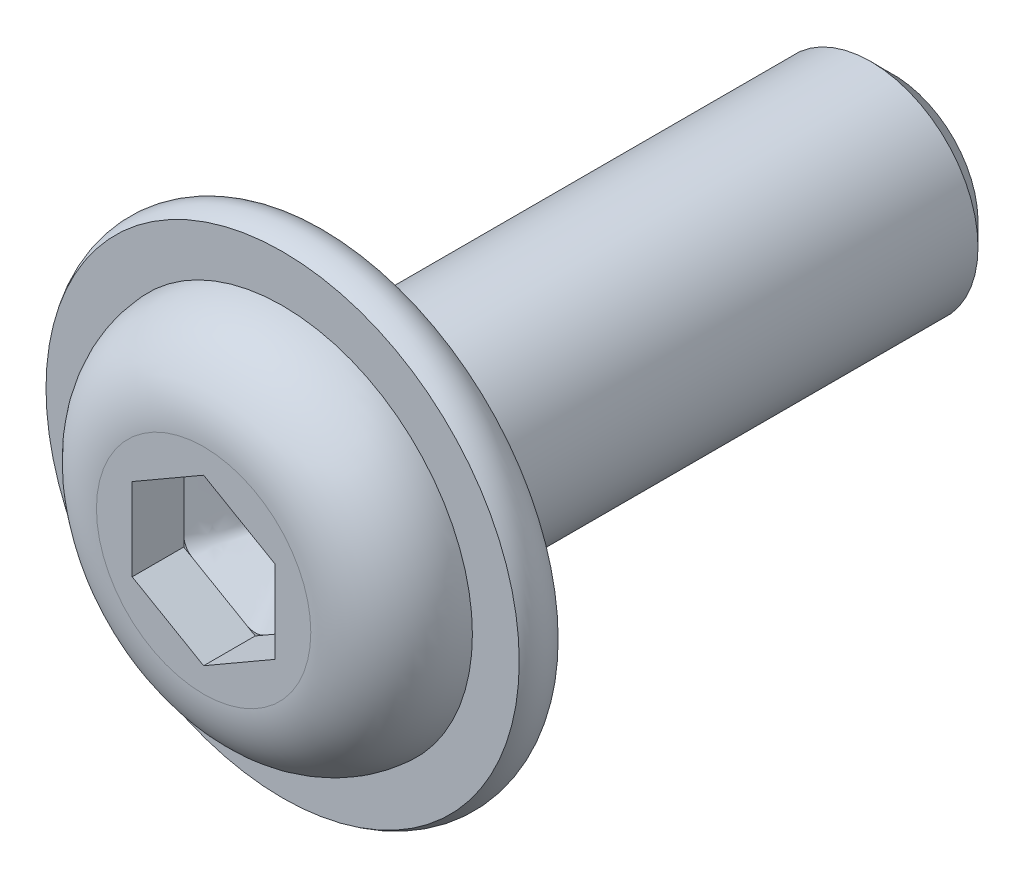
ISO-10303-21;
HEADER;
FILE_DESCRIPTION(('STEP AP214'),'2;1');
FILE_NAME('part.step','',(''),(''),'','','');
FILE_SCHEMA(('AUTOMOTIVE_DESIGN { 1 0 10303 214 1 1 1 1 }'));
ENDSEC;
DATA;
#1=APPLICATION_CONTEXT('core data for automotive mechanical design processes');
#2=APPLICATION_PROTOCOL_DEFINITION('international standard','automotive_design',2000,#1);
#3=PRODUCT_CONTEXT('',#1,'mechanical');
#4=PRODUCT('Part','Part','',(#3));
#5=PRODUCT_RELATED_PRODUCT_CATEGORY('part','',(#4));
#6=PRODUCT_DEFINITION_FORMATION('','',#4);
#7=PRODUCT_DEFINITION_CONTEXT('part definition',#1,'design');
#8=PRODUCT_DEFINITION('design','',#6,#7);
#9=PRODUCT_DEFINITION_SHAPE('','',#8);
#10=(LENGTH_UNIT() NAMED_UNIT(*) SI_UNIT(.MILLI.,.METRE.));
#11=(NAMED_UNIT(*) PLANE_ANGLE_UNIT() SI_UNIT($,.RADIAN.));
#12=(NAMED_UNIT(*) SI_UNIT($,.STERADIAN.) SOLID_ANGLE_UNIT());
#13=UNCERTAINTY_MEASURE_WITH_UNIT(LENGTH_MEASURE(1.E-05),#10,'distance_accuracy_value','');
#14=(GEOMETRIC_REPRESENTATION_CONTEXT(3) GLOBAL_UNCERTAINTY_ASSIGNED_CONTEXT((#13)) GLOBAL_UNIT_ASSIGNED_CONTEXT((#10,
#11,#12)) REPRESENTATION_CONTEXT('',''));
#15=CARTESIAN_POINT('',(0.,0.,0.));
#16=DIRECTION('',(0.,0.,1.));
#17=DIRECTION('',(1.,0.,0.));
#18=AXIS2_PLACEMENT_3D('',#15,#16,#17);
#19=CARTESIAN_POINT('',(0.,0.,8.20625));
#20=DIRECTION('',(0.,0.,1.));
#21=DIRECTION('',(1.,0.,0.));
#22=AXIS2_PLACEMENT_3D('',#19,#20,#21);
#23=PLANE('',#22);
#24=CARTESIAN_POINT('',(-1.5,0.866025403784432,8.20625));
#25=DIRECTION('',(0.,0.,1.));
#26=DIRECTION('',(1.,0.,0.));
#27=AXIS2_PLACEMENT_3D('',#24,#25,#26);
#28=CIRCLE('',#27,0.5);
#29=CARTESIAN_POINT('',(-1.75,1.29903810567665,8.20625));
#30=VERTEX_POINT('',#29);
#31=CARTESIAN_POINT('',(-2.,0.866025403800663,8.20625));
#32=VERTEX_POINT('',#31);
#33=EDGE_CURVE('E515',#30,#32,#28,.T.);
#34=ORIENTED_EDGE('',*,*,#33,.F.);
#35=DIRECTION('',(-0.866025403784438,-0.5,0.));
#36=VECTOR('',#35,1.);
#37=CARTESIAN_POINT('',(0.,2.3094010767585,8.20625));
#38=LINE('',#37,#36);
#39=CARTESIAN_POINT('',(-2.,1.15470053837925,8.20625));
#40=VERTEX_POINT('',#39);
#41=EDGE_CURVE('E368',#30,#40,#38,.T.);
#42=ORIENTED_EDGE('',*,*,#41,.T.);
#43=DIRECTION('',(0.,-1.,0.));
#44=VECTOR('',#43,1.);
#45=CARTESIAN_POINT('',(-2.,1.15470053837925,8.20625));
#46=LINE('',#45,#44);
#47=EDGE_CURVE('E377',#40,#32,#46,.T.);
#48=ORIENTED_EDGE('',*,*,#47,.T.);
#49=EDGE_LOOP('',(#34,#42,#48));
#50=FACE_BOUND('',#49,.T.);
#51=ADVANCED_FACE('F258',(#50),#23,.T.);
#52=CARTESIAN_POINT('',(-1.5,-0.86602540378444,8.20625));
#53=DIRECTION('',(0.,0.,1.));
#54=DIRECTION('',(-1.,0.,0.));
#55=AXIS2_PLACEMENT_3D('',#52,#53,#54);
#56=CIRCLE('',#55,0.5);
#57=CARTESIAN_POINT('',(-2.,-0.866025403840202,8.20625));
#58=VERTEX_POINT('',#57);
#59=CARTESIAN_POINT('',(-1.74999999999966,-1.29903810567685,8.20625));
#60=VERTEX_POINT('',#59);
#61=EDGE_CURVE('E506',#58,#60,#56,.T.);
#62=ORIENTED_EDGE('',*,*,#61,.F.);
#63=CARTESIAN_POINT('',(-2.,-1.15470053837926,8.20625));
#64=VERTEX_POINT('',#63);
#65=EDGE_CURVE('E375',#58,#64,#46,.T.);
#66=ORIENTED_EDGE('',*,*,#65,.T.);
#67=DIRECTION('',(0.866025403784438,-0.5,0.));
#68=VECTOR('',#67,1.);
#69=CARTESIAN_POINT('',(-2.,-1.15470053837926,8.20625));
#70=LINE('',#69,#68);
#71=EDGE_CURVE('E400',#64,#60,#70,.T.);
#72=ORIENTED_EDGE('',*,*,#71,.T.);
#73=EDGE_LOOP('',(#62,#66,#72));
#74=FACE_BOUND('',#73,.T.);
#75=ADVANCED_FACE('F692',(#74),#23,.T.);
#76=CARTESIAN_POINT('',(0.,-1.73205080756888,8.20625));
#77=DIRECTION('',(0.,0.,1.));
#78=DIRECTION('',(1.,0.,0.));
#79=AXIS2_PLACEMENT_3D('',#76,#77,#78);
#80=CIRCLE('',#79,0.499999999999999);
#81=CARTESIAN_POINT('',(-0.250000000022286,-2.16506350944823,8.20625));
#82=VERTEX_POINT('',#81);
#83=CARTESIAN_POINT('',(0.250000000041184,-2.16506350943732,8.20625));
#84=VERTEX_POINT('',#83);
#85=EDGE_CURVE('E580',#82,#84,#80,.T.);
#86=ORIENTED_EDGE('',*,*,#85,.F.);
#87=CARTESIAN_POINT('',(0.,-2.30940107675851,8.20625));
#88=VERTEX_POINT('',#87);
#89=EDGE_CURVE('E397',#82,#88,#70,.T.);
#90=ORIENTED_EDGE('',*,*,#89,.T.);
#91=DIRECTION('',(0.866025403784439,0.5,0.));
#92=VECTOR('',#91,1.);
#93=CARTESIAN_POINT('',(0.,-2.30940107675851,8.20625));
#94=LINE('',#93,#92);
#95=EDGE_CURVE('E410',#88,#84,#94,.T.);
#96=ORIENTED_EDGE('',*,*,#95,.T.);
#97=EDGE_LOOP('',(#86,#90,#96));
#98=FACE_BOUND('',#97,.T.);
#99=ADVANCED_FACE('F696',(#98),#23,.T.);
#100=CARTESIAN_POINT('',(1.5,-0.866025403784441,8.20625));
#101=DIRECTION('',(0.,0.,1.));
#102=DIRECTION('',(1.,0.,0.));
#103=AXIS2_PLACEMENT_3D('',#100,#101,#102);
#104=CIRCLE('',#103,0.5);
#105=CARTESIAN_POINT('',(1.75000000000617,-1.29903810567309,8.20625));
#106=VERTEX_POINT('',#105);
#107=CARTESIAN_POINT('',(2.,-0.866025403800671,8.20625));
#108=VERTEX_POINT('',#107);
#109=EDGE_CURVE('E545',#106,#108,#104,.T.);
#110=ORIENTED_EDGE('',*,*,#109,.F.);
#111=CARTESIAN_POINT('',(2.,-1.15470053837926,8.20625));
#112=VERTEX_POINT('',#111);
#113=EDGE_CURVE('E408',#106,#112,#94,.T.);
#114=ORIENTED_EDGE('',*,*,#113,.T.);
#115=DIRECTION('',(0.,1.,0.));
#116=VECTOR('',#115,1.);
#117=CARTESIAN_POINT('',(2.,-1.15470053837926,8.20625));
#118=LINE('',#117,#116);
#119=EDGE_CURVE('E424',#112,#108,#118,.T.);
#120=ORIENTED_EDGE('',*,*,#119,.T.);
#121=EDGE_LOOP('',(#110,#114,#120));
#122=FACE_BOUND('',#121,.T.);
#123=ADVANCED_FACE('F700',(#122),#23,.T.);
#124=CARTESIAN_POINT('',(1.5,0.866025403784433,8.20625));
#125=DIRECTION('',(0.,0.,1.));
#126=DIRECTION('',(1.,0.,0.));
#127=AXIS2_PLACEMENT_3D('',#124,#125,#126);
#128=CIRCLE('',#127,0.5);
#129=CARTESIAN_POINT('',(2.,0.866025403840194,8.20625));
#130=VERTEX_POINT('',#129);
#131=CARTESIAN_POINT('',(1.74999999999966,1.29903810567685,8.20625));
#132=VERTEX_POINT('',#131);
#133=EDGE_CURVE('E438',#130,#132,#128,.T.);
#134=ORIENTED_EDGE('',*,*,#133,.F.);
#135=CARTESIAN_POINT('',(2.,1.15470053837925,8.20625));
#136=VERTEX_POINT('',#135);
#137=EDGE_CURVE('E412',#130,#136,#118,.T.);
#138=ORIENTED_EDGE('',*,*,#137,.T.);
#139=DIRECTION('',(-0.866025403784439,0.5,0.));
#140=VECTOR('',#139,1.);
#141=CARTESIAN_POINT('',(2.,1.15470053837925,8.20625));
#142=LINE('',#141,#140);
#143=EDGE_CURVE('E429',#136,#132,#142,.T.);
#144=ORIENTED_EDGE('',*,*,#143,.T.);
#145=EDGE_LOOP('',(#134,#138,#144));
#146=FACE_BOUND('',#145,.T.);
#147=ADVANCED_FACE('F436',(#146),#23,.T.);
#148=CARTESIAN_POINT('',(0.,0.,9.65));
#149=DIRECTION('',(0.,0.,-1.));
#150=DIRECTION('',(0.,1.,0.));
#151=AXIS2_PLACEMENT_3D('',#148,#149,#150);
#152=PLANE('',#151);
#153=DIRECTION('',(0.,-1.,0.));
#154=VECTOR('',#153,1.);
#155=CARTESIAN_POINT('',(-2.,1.15470053837925,9.65));
#156=LINE('',#155,#154);
#157=CARTESIAN_POINT('',(-2.,1.15470053837925,9.65));
#158=VERTEX_POINT('',#157);
#159=CARTESIAN_POINT('',(-2.,-1.15470053837926,9.65));
#160=VERTEX_POINT('',#159);
#161=EDGE_CURVE('E618',#158,#160,#156,.T.);
#162=ORIENTED_EDGE('',*,*,#161,.F.);
#163=DIRECTION('',(-0.866025403784438,-0.5,0.));
#164=VECTOR('',#163,1.);
#165=CARTESIAN_POINT('',(0.,2.3094010767585,9.65));
#166=LINE('',#165,#164);
#167=CARTESIAN_POINT('',(0.,2.3094010767585,9.65));
#168=VERTEX_POINT('',#167);
#169=EDGE_CURVE('E284',#168,#158,#166,.T.);
#170=ORIENTED_EDGE('',*,*,#169,.F.);
#171=DIRECTION('',(-0.866025403784439,0.5,0.));
#172=VECTOR('',#171,1.);
#173=CARTESIAN_POINT('',(2.,1.15470053837925,9.65));
#174=LINE('',#173,#172);
#175=CARTESIAN_POINT('',(2.,1.15470053837925,9.65));
#176=VERTEX_POINT('',#175);
#177=EDGE_CURVE('E379',#176,#168,#174,.T.);
#178=ORIENTED_EDGE('',*,*,#177,.F.);
#179=DIRECTION('',(0.,1.,0.));
#180=VECTOR('',#179,1.);
#181=CARTESIAN_POINT('',(2.,-1.15470053837926,9.65));
#182=LINE('',#181,#180);
#183=CARTESIAN_POINT('',(2.,-1.15470053837926,9.65));
#184=VERTEX_POINT('',#183);
#185=EDGE_CURVE('E446',#184,#176,#182,.T.);
#186=ORIENTED_EDGE('',*,*,#185,.F.);
#187=DIRECTION('',(0.866025403784439,0.5,0.));
#188=VECTOR('',#187,1.);
#189=CARTESIAN_POINT('',(0.,-2.30940107675851,9.65));
#190=LINE('',#189,#188);
#191=CARTESIAN_POINT('',(0.,-2.30940107675851,9.65));
#192=VERTEX_POINT('',#191);
#193=EDGE_CURVE('E625',#192,#184,#190,.T.);
#194=ORIENTED_EDGE('',*,*,#193,.F.);
#195=DIRECTION('',(0.866025403784438,-0.5,0.));
#196=VECTOR('',#195,1.);
#197=CARTESIAN_POINT('',(-2.,-1.15470053837926,9.65));
#198=LINE('',#197,#196);
#199=EDGE_CURVE('E620',#160,#192,#198,.T.);
#200=ORIENTED_EDGE('',*,*,#199,.F.);
#201=EDGE_LOOP('',(#162,#170,#178,#186,#194,#200));
#202=FACE_BOUND('',#201,.T.);
#203=CARTESIAN_POINT('',(0.,0.,9.65));
#204=DIRECTION('',(0.,0.,1.));
#205=DIRECTION('',(0.,-1.,0.));
#206=AXIS2_PLACEMENT_3D('',#203,#204,#205);
#207=CIRCLE('',#206,3.);
#208=CARTESIAN_POINT('',(0.,-3.00000000000001,9.65));
#209=VERTEX_POINT('',#208);
#210=EDGE_CURVE('E12',#209,#209,#207,.T.);
#211=ORIENTED_EDGE('',*,*,#210,.T.);
#212=EDGE_LOOP('',(#211));
#213=FACE_BOUND('',#212,.T.);
#214=ADVANCED_FACE('F260',(#202,#213),#152,.F.);
#215=CARTESIAN_POINT('',(0.,0.,7.33552581058345));
#216=DIRECTION('',(0.,0.,1.));
#217=DIRECTION('',(0.,-1.,0.));
#218=AXIS2_PLACEMENT_3D('',#215,#216,#217);
#219=TOROIDAL_SURFACE('',#218,3.,2.31447418941655);
#220=ORIENTED_EDGE('',*,*,#210,.F.);
#221=EDGE_LOOP('',(#220));
#222=FACE_BOUND('',#221,.T.);
#223=CARTESIAN_POINT('',(0.,0.,7.439));
#224=DIRECTION('',(0.,0.,1.));
#225=DIRECTION('',(0.,-1.,0.));
#226=AXIS2_PLACEMENT_3D('',#223,#224,#225);
#227=CIRCLE('',#226,5.31216);
#228=CARTESIAN_POINT('',(0.,-5.31216000000001,7.439));
#229=VERTEX_POINT('',#228);
#230=EDGE_CURVE('E268',#229,#229,#227,.T.);
#231=ORIENTED_EDGE('',*,*,#230,.T.);
#232=EDGE_LOOP('',(#231));
#233=FACE_BOUND('',#232,.T.);
#234=ADVANCED_FACE('F652',(#222,#233),#219,.T.);
#235=CARTESIAN_POINT('',(0.,6.6232,7.439));
#236=DIRECTION('',(0.,0.,-1.));
#237=DIRECTION('',(0.,1.,0.));
#238=AXIS2_PLACEMENT_3D('',#235,#236,#237);
#239=PLANE('',#238);
#240=ORIENTED_EDGE('',*,*,#230,.F.);
#241=EDGE_LOOP('',(#240));
#242=FACE_BOUND('',#241,.T.);
#243=CARTESIAN_POINT('',(0.,0.,7.439));
#244=DIRECTION('',(0.,0.,1.));
#245=DIRECTION('',(0.,-1.,0.));
#246=AXIS2_PLACEMENT_3D('',#243,#244,#245);
#247=CIRCLE('',#246,6.6232);
#248=CARTESIAN_POINT('',(0.,-6.6232,7.439));
#249=VERTEX_POINT('',#248);
#250=EDGE_CURVE('E647',#249,#249,#247,.T.);
#251=ORIENTED_EDGE('',*,*,#250,.T.);
#252=EDGE_LOOP('',(#251));
#253=FACE_BOUND('',#252,.T.);
#254=ADVANCED_FACE('F654',(#242,#253),#239,.F.);
#255=CARTESIAN_POINT('',(0.,0.,6.8945));
#256=DIRECTION('',(0.,0.,1.));
#257=DIRECTION('',(0.,-1.,0.));
#258=AXIS2_PLACEMENT_3D('',#255,#256,#257);
#259=TOROIDAL_SURFACE('',#258,5.87313775452489,0.926862245475111);
#260=ORIENTED_EDGE('',*,*,#250,.F.);
#261=EDGE_LOOP('',(#260));
#262=FACE_BOUND('',#261,.T.);
#263=CARTESIAN_POINT('',(0.,0.,6.35));
#264=DIRECTION('',(0.,0.,1.));
#265=DIRECTION('',(0.,-1.,0.));
#266=AXIS2_PLACEMENT_3D('',#263,#264,#265);
#267=CIRCLE('',#266,6.6232);
#268=CARTESIAN_POINT('',(0.,-6.6232,6.35));
#269=VERTEX_POINT('',#268);
#270=EDGE_CURVE('E644',#269,#269,#267,.T.);
#271=ORIENTED_EDGE('',*,*,#270,.T.);
#272=EDGE_LOOP('',(#271));
#273=FACE_BOUND('',#272,.T.);
#274=ADVANCED_FACE('F657',(#262,#273),#259,.T.);
#275=CARTESIAN_POINT('',(0.,3.,6.35));
#276=DIRECTION('',(0.,0.,1.));
#277=DIRECTION('',(0.,-1.,0.));
#278=AXIS2_PLACEMENT_3D('',#275,#276,#277);
#279=PLANE('',#278);
#280=ORIENTED_EDGE('',*,*,#270,.F.);
#281=EDGE_LOOP('',(#280));
#282=FACE_BOUND('',#281,.T.);
#283=CARTESIAN_POINT('',(0.,0.,6.35));
#284=DIRECTION('',(0.,0.,1.));
#285=DIRECTION('',(0.,-1.,0.));
#286=AXIS2_PLACEMENT_3D('',#283,#284,#285);
#287=CIRCLE('',#286,3.);
#288=CARTESIAN_POINT('',(0.,-3.00000000000001,6.35));
#289=VERTEX_POINT('',#288);
#290=EDGE_CURVE('E641',#289,#289,#287,.T.);
#291=ORIENTED_EDGE('',*,*,#290,.T.);
#292=EDGE_LOOP('',(#291));
#293=FACE_BOUND('',#292,.T.);
#294=ADVANCED_FACE('F663',(#282,#293),#279,.F.);
#295=CARTESIAN_POINT('',(0.,0.,9.65));
#296=DIRECTION('',(0.,0.,1.));
#297=DIRECTION('',(0.,-1.,0.));
#298=AXIS2_PLACEMENT_3D('',#295,#296,#297);
#299=CYLINDRICAL_SURFACE('',#298,3.);
#300=ORIENTED_EDGE('',*,*,#290,.F.);
#301=EDGE_LOOP('',(#300));
#302=FACE_BOUND('',#301,.T.);
#303=CARTESIAN_POINT('',(0.,0.,-9.025));
#304=DIRECTION('',(0.,0.,1.));
#305=DIRECTION('',(0.,-1.,0.));
#306=AXIS2_PLACEMENT_3D('',#303,#304,#305);
#307=CIRCLE('',#306,3.);
#308=CARTESIAN_POINT('',(0.,-3.,-9.025));
#309=VERTEX_POINT('',#308);
#310=EDGE_CURVE('E638',#309,#309,#307,.T.);
#311=ORIENTED_EDGE('',*,*,#310,.T.);
#312=EDGE_LOOP('',(#311));
#313=FACE_BOUND('',#312,.T.);
#314=ADVANCED_FACE('F669',(#302,#313),#299,.T.);
#315=CARTESIAN_POINT('',(0.,0.,-9.65));
#316=DIRECTION('',(0.,0.,1.));
#317=DIRECTION('',(0.,-1.,0.));
#318=AXIS2_PLACEMENT_3D('',#315,#316,#317);
#319=CONICAL_SURFACE('',#318,2.37500000000001,0.785398163397443);
#320=ORIENTED_EDGE('',*,*,#310,.F.);
#321=EDGE_LOOP('',(#320));
#322=FACE_BOUND('',#321,.T.);
#323=CARTESIAN_POINT('',(0.,0.,-9.65));
#324=DIRECTION('',(0.,0.,1.));
#325=DIRECTION('',(0.,-1.,0.));
#326=AXIS2_PLACEMENT_3D('',#323,#324,#325);
#327=CIRCLE('',#326,2.37500000000001);
#328=CARTESIAN_POINT('',(0.,-2.37500000000001,-9.65));
#329=VERTEX_POINT('',#328);
#330=EDGE_CURVE('E630',#329,#329,#327,.T.);
#331=ORIENTED_EDGE('',*,*,#330,.T.);
#332=EDGE_LOOP('',(#331));
#333=FACE_BOUND('',#332,.T.);
#334=ADVANCED_FACE('F675',(#322,#333),#319,.T.);
#335=CARTESIAN_POINT('',(0.,2.37500000000001,-9.65));
#336=DIRECTION('',(0.,0.,1.));
#337=DIRECTION('',(0.,-1.,0.));
#338=AXIS2_PLACEMENT_3D('',#335,#336,#337);
#339=PLANE('',#338);
#340=ORIENTED_EDGE('',*,*,#330,.F.);
#341=EDGE_LOOP('',(#340));
#342=FACE_BOUND('',#341,.T.);
#343=ADVANCED_FACE('F681',(#342),#339,.F.);
#344=CARTESIAN_POINT('',(0.,2.3094010767585,8.20625));
#345=DIRECTION('',(-0.5,0.866025403784438,0.));
#346=DIRECTION('',(-0.866025403784439,-0.5,0.));
#347=AXIS2_PLACEMENT_3D('',#344,#345,#346);
#348=PLANE('',#347);
#349=ORIENTED_EDGE('',*,*,#169,.T.);
#350=DIRECTION('',(0.,0.,1.));
#351=VECTOR('',#350,1.);
#352=CARTESIAN_POINT('',(-2.,1.15470053837925,8.20625));
#353=LINE('',#352,#351);
#354=EDGE_CURVE('E455',#40,#158,#353,.T.);
#355=ORIENTED_EDGE('',*,*,#354,.F.);
#356=ORIENTED_EDGE('',*,*,#41,.F.);
#357=DIRECTION('',(-0.866025403784439,-0.499999999999999,0.));
#358=VECTOR('',#357,1.);
#359=CARTESIAN_POINT('',(-0.249999999999999,2.16506350946109,8.20625));
#360=LINE('',#359,#358);
#361=CARTESIAN_POINT('',(-0.249999999999999,2.16506350946109,8.20625));
#362=VERTEX_POINT('',#361);
#363=EDGE_CURVE('E353',#362,#30,#360,.T.);
#364=ORIENTED_EDGE('',*,*,#363,.F.);
#365=CARTESIAN_POINT('',(0.,2.3094010767585,8.20625));
#366=VERTEX_POINT('',#365);
#367=EDGE_CURVE('E367',#366,#362,#38,.T.);
#368=ORIENTED_EDGE('',*,*,#367,.F.);
#369=DIRECTION('',(0.,0.,1.));
#370=VECTOR('',#369,1.);
#371=CARTESIAN_POINT('',(0.,2.3094010767585,8.20625));
#372=LINE('',#371,#370);
#373=EDGE_CURVE('E450',#366,#168,#372,.T.);
#374=ORIENTED_EDGE('',*,*,#373,.T.);
#375=EDGE_LOOP('',(#349,#355,#356,#364,#368,#374));
#376=FACE_BOUND('',#375,.T.);
#377=ADVANCED_FACE('F366',(#376),#348,.F.);
#378=CARTESIAN_POINT('',(2.,1.15470053837925,8.20625));
#379=DIRECTION('',(0.5,0.866025403784439,0.));
#380=DIRECTION('',(-0.866025403784439,0.5,0.));
#381=AXIS2_PLACEMENT_3D('',#378,#379,#380);
#382=PLANE('',#381);
#383=ORIENTED_EDGE('',*,*,#177,.T.);
#384=ORIENTED_EDGE('',*,*,#373,.F.);
#385=CARTESIAN_POINT('',(0.250000000000004,2.1650635094611,8.20625));
#386=VERTEX_POINT('',#385);
#387=EDGE_CURVE('E373',#386,#366,#142,.T.);
#388=ORIENTED_EDGE('',*,*,#387,.F.);
#389=DIRECTION('',(-0.866025403784439,0.5,0.));
#390=VECTOR('',#389,1.);
#391=CARTESIAN_POINT('',(1.75,1.29903810567665,8.20625));
#392=LINE('',#391,#390);
#393=EDGE_CURVE('E262',#132,#386,#392,.T.);
#394=ORIENTED_EDGE('',*,*,#393,.F.);
#395=ORIENTED_EDGE('',*,*,#143,.F.);
#396=DIRECTION('',(0.,0.,1.));
#397=VECTOR('',#396,1.);
#398=CARTESIAN_POINT('',(2.,1.15470053837925,8.20625));
#399=LINE('',#398,#397);
#400=EDGE_CURVE('E443',#136,#176,#399,.T.);
#401=ORIENTED_EDGE('',*,*,#400,.T.);
#402=EDGE_LOOP('',(#383,#384,#388,#394,#395,#401));
#403=FACE_BOUND('',#402,.T.);
#404=ADVANCED_FACE('F453',(#403),#382,.F.);
#405=CARTESIAN_POINT('',(2.,-1.15470053837926,8.20625));
#406=DIRECTION('',(1.,0.,0.));
#407=DIRECTION('',(0.,0.,-1.));
#408=AXIS2_PLACEMENT_3D('',#405,#406,#407);
#409=PLANE('',#408);
#410=ORIENTED_EDGE('',*,*,#185,.T.);
#411=ORIENTED_EDGE('',*,*,#400,.F.);
#412=ORIENTED_EDGE('',*,*,#137,.F.);
#413=DIRECTION('',(0.,1.,0.));
#414=VECTOR('',#413,1.);
#415=CARTESIAN_POINT('',(2.,-0.866025403784441,8.20625));
#416=LINE('',#415,#414);
#417=EDGE_CURVE('E536',#108,#130,#416,.T.);
#418=ORIENTED_EDGE('',*,*,#417,.F.);
#419=ORIENTED_EDGE('',*,*,#119,.F.);
#420=DIRECTION('',(0.,0.,1.));
#421=VECTOR('',#420,1.);
#422=CARTESIAN_POINT('',(2.,-1.15470053837926,8.20625));
#423=LINE('',#422,#421);
#424=EDGE_CURVE('E451',#112,#184,#423,.T.);
#425=ORIENTED_EDGE('',*,*,#424,.T.);
#426=EDGE_LOOP('',(#410,#411,#412,#418,#419,#425));
#427=FACE_BOUND('',#426,.T.);
#428=ADVANCED_FACE('F444',(#427),#409,.F.);
#429=CARTESIAN_POINT('',(0.,-2.30940107675851,8.20625));
#430=DIRECTION('',(0.5,-0.866025403784439,0.));
#431=DIRECTION('',(0.866025403784439,0.5,0.));
#432=AXIS2_PLACEMENT_3D('',#429,#430,#431);
#433=PLANE('',#432);
#434=ORIENTED_EDGE('',*,*,#193,.T.);
#435=ORIENTED_EDGE('',*,*,#424,.F.);
#436=ORIENTED_EDGE('',*,*,#113,.F.);
#437=DIRECTION('',(0.866025403784439,0.5,0.));
#438=VECTOR('',#437,1.);
#439=CARTESIAN_POINT('',(0.249999999999999,-2.1650635094611,8.20625));
#440=LINE('',#439,#438);
#441=EDGE_CURVE('E573',#84,#106,#440,.T.);
#442=ORIENTED_EDGE('',*,*,#441,.F.);
#443=ORIENTED_EDGE('',*,*,#95,.F.);
#444=DIRECTION('',(0.,0.,1.));
#445=VECTOR('',#444,1.);
#446=CARTESIAN_POINT('',(0.,-2.30940107675851,8.20625));
#447=LINE('',#446,#445);
#448=EDGE_CURVE('E633',#88,#192,#447,.T.);
#449=ORIENTED_EDGE('',*,*,#448,.T.);
#450=EDGE_LOOP('',(#434,#435,#436,#442,#443,#449));
#451=FACE_BOUND('',#450,.T.);
#452=ADVANCED_FACE('F558',(#451),#433,.F.);
#453=CARTESIAN_POINT('',(-2.,-1.15470053837926,8.20625));
#454=DIRECTION('',(-0.5,-0.866025403784439,0.));
#455=DIRECTION('',(0.866025403784439,-0.5,0.));
#456=AXIS2_PLACEMENT_3D('',#453,#454,#455);
#457=PLANE('',#456);
#458=ORIENTED_EDGE('',*,*,#199,.T.);
#459=ORIENTED_EDGE('',*,*,#448,.F.);
#460=ORIENTED_EDGE('',*,*,#89,.F.);
#461=DIRECTION('',(0.866025403784439,-0.5,0.));
#462=VECTOR('',#461,1.);
#463=CARTESIAN_POINT('',(-1.75,-1.29903810567666,8.20625));
#464=LINE('',#463,#462);
#465=EDGE_CURVE('E589',#60,#82,#464,.T.);
#466=ORIENTED_EDGE('',*,*,#465,.F.);
#467=ORIENTED_EDGE('',*,*,#71,.F.);
#468=DIRECTION('',(0.,0.,1.));
#469=VECTOR('',#468,1.);
#470=CARTESIAN_POINT('',(-2.,-1.15470053837926,8.20625));
#471=LINE('',#470,#469);
#472=EDGE_CURVE('E456',#64,#160,#471,.T.);
#473=ORIENTED_EDGE('',*,*,#472,.T.);
#474=EDGE_LOOP('',(#458,#459,#460,#466,#467,#473));
#475=FACE_BOUND('',#474,.T.);
#476=ADVANCED_FACE('F562',(#475),#457,.F.);
#477=CARTESIAN_POINT('',(-2.,1.15470053837925,8.20625));
#478=DIRECTION('',(-1.,0.,0.));
#479=DIRECTION('',(0.,0.,1.));
#480=AXIS2_PLACEMENT_3D('',#477,#478,#479);
#481=PLANE('',#480);
#482=ORIENTED_EDGE('',*,*,#161,.T.);
#483=ORIENTED_EDGE('',*,*,#472,.F.);
#484=ORIENTED_EDGE('',*,*,#65,.F.);
#485=DIRECTION('',(0.,-1.,0.));
#486=VECTOR('',#485,1.);
#487=CARTESIAN_POINT('',(-2.,0.866025403784432,8.20625));
#488=LINE('',#487,#486);
#489=EDGE_CURVE('E518',#32,#58,#488,.T.);
#490=ORIENTED_EDGE('',*,*,#489,.F.);
#491=ORIENTED_EDGE('',*,*,#47,.F.);
#492=ORIENTED_EDGE('',*,*,#354,.T.);
#493=EDGE_LOOP('',(#482,#483,#484,#490,#491,#492));
#494=FACE_BOUND('',#493,.T.);
#495=ADVANCED_FACE('F473',(#494),#481,.F.);
#496=CARTESIAN_POINT('',(0.,1.73205080756887,8.20625));
#497=DIRECTION('',(0.,0.,1.));
#498=DIRECTION('',(1.,0.,0.));
#499=AXIS2_PLACEMENT_3D('',#496,#497,#498);
#500=CIRCLE('',#499,0.499999999999999);
#501=EDGE_CURVE('E348',#386,#362,#500,.T.);
#502=ORIENTED_EDGE('',*,*,#501,.F.);
#503=ORIENTED_EDGE('',*,*,#387,.T.);
#504=ORIENTED_EDGE('',*,*,#367,.T.);
#505=EDGE_LOOP('',(#502,#503,#504));
#506=FACE_BOUND('',#505,.T.);
#507=ADVANCED_FACE('F372',(#506),#23,.T.);
#508=CARTESIAN_POINT('',(0.,0.,6.8945));
#509=DIRECTION('',(0.,0.,1.));
#510=DIRECTION('',(1.,0.,0.));
#511=AXIS2_PLACEMENT_3D('',#508,#509,#510);
#512=PLANE('',#511);
#513=CARTESIAN_POINT('',(0.,0.,6.8945));
#514=DIRECTION('',(0.,0.,1.));
#515=DIRECTION('',(1.,0.,0.));
#516=AXIS2_PLACEMENT_3D('',#513,#514,#515);
#517=CIRCLE('',#516,0.14);
#518=CARTESIAN_POINT('',(0.14,0.,6.8945));
#519=VERTEX_POINT('',#518);
#520=EDGE_CURVE('E369',#519,#519,#517,.T.);
#521=ORIENTED_EDGE('',*,*,#520,.T.);
#522=EDGE_LOOP('',(#521));
#523=FACE_BOUND('',#522,.T.);
#524=ADVANCED_FACE('F472',(#523),#512,.T.);
#525=CARTESIAN_POINT('',(0.250000000218931,2.16506350933469,8.20625));
#526=CARTESIAN_POINT('',(0.0160591013573202,0.139075897493399,6.8945));
#527=CARTESIAN_POINT('',(0.376022999407542,2.09230409682906,8.20625));
#528=CARTESIAN_POINT('',(0.0254547773962102,0.137990978275345,6.8945));
#529=CARTESIAN_POINT('',(0.626516071467939,1.94768185424485,8.20625));
#530=CARTESIAN_POINT('',(0.0441398191294548,0.133894296169148,6.8945));
#531=CARTESIAN_POINT('',(0.999999999999998,1.73205080756887,8.20625));
#532=CARTESIAN_POINT('',(0.0704939403286218,0.122099086274899,6.8945));
#533=CARTESIAN_POINT('',(1.37348392853206,1.51641976089289,8.20625));
#534=CARTESIAN_POINT('',(0.0938859523395946,0.10517335276913,6.89450000000001));
#535=CARTESIAN_POINT('',(1.62397700059245,1.37179751830868,8.20625));
#536=CARTESIAN_POINT('',(0.106776303981413,0.0910399730104669,6.8945));
#537=CARTESIAN_POINT('',(1.78676448706453,1.27781211917332,8.20625));
#538=CARTESIAN_POINT('',(0.114058300899076,0.0812300262889485,6.8945));
#539=CARTESIAN_POINT('',(1.85634300413424,1.22502963316572,8.20625));
#540=CARTESIAN_POINT('',(0.117145912667967,0.0767988941630477,6.8945));
#541=CARTESIAN_POINT('',(1.93818258723332,1.1189919245169,8.20625000000001));
#542=CARTESIAN_POINT('',(0.121308145018241,0.0700372901811724,6.89450000000001));
#543=CARTESIAN_POINT('',(1.9890730366931,0.9951345868392,8.20624999999999));
#544=CARTESIAN_POINT('',(0.125082749661738,0.0630518892384442,6.89449999999999));
#545=CARTESIAN_POINT('',(2.,0.908477376791092,8.20625));
#546=CARTESIAN_POINT('',(0.127376416765848,0.0581623729466103,6.8945));
#547=CARTESIAN_POINT('',(2.,0.720506578520375,8.20625));
#548=CARTESIAN_POINT('',(0.132231081377623,0.0469510052648751,6.8945));
#549=CARTESIAN_POINT('',(2.,0.431262093351963,8.20625));
#550=CARTESIAN_POINT('',(0.138025771469049,0.0287209434000142,6.8945));
#551=CARTESIAN_POINT('',(2.,0.,8.20625));
#552=CARTESIAN_POINT('',(0.140987880657243,0.,6.8945));
#553=CARTESIAN_POINT('',(1.99999999999999,-0.43126209335197,8.20625));
#554=CARTESIAN_POINT('',(0.138025771469049,-0.0287209434000202,6.8945));
#555=CARTESIAN_POINT('',(2.,-0.720506578520383,8.20625));
#556=CARTESIAN_POINT('',(0.132231081377623,-0.0469510052648811,6.8945));
#557=CARTESIAN_POINT('',(2.,-0.9084773767911,8.20625));
#558=CARTESIAN_POINT('',(0.127376416765848,-0.0581623729466164,6.8945));
#559=CARTESIAN_POINT('',(1.98907828477737,-0.995125383134914,8.20625000000001));
#560=CARTESIAN_POINT('',(0.125082749661738,-0.0630518892384503,6.89450000000001));
#561=CARTESIAN_POINT('',(1.93816672687794,-1.11901939545825,8.20624999999999));
#562=CARTESIAN_POINT('',(0.12130814501824,-0.0700372901811784,6.89449999999999));
#563=CARTESIAN_POINT('',(1.85634835073383,-1.22502048633929,8.20625000000001));
#564=CARTESIAN_POINT('',(0.117145912667967,-0.0767988941630538,6.89450000000001));
#565=CARTESIAN_POINT('',(1.78676448706453,-1.27781211917333,8.20625));
#566=CARTESIAN_POINT('',(0.114058300899076,-0.0812300262889545,6.8945));
#567=CARTESIAN_POINT('',(1.62397700059245,-1.37179751830869,8.20625));
#568=CARTESIAN_POINT('',(0.106776303981413,-0.0910399730104729,6.8945));
#569=CARTESIAN_POINT('',(1.37348392853206,-1.51641976089289,8.20624999999999));
#570=CARTESIAN_POINT('',(0.0938859523395945,-0.105173352769137,6.8945));
#571=CARTESIAN_POINT('',(0.999999999999999,-1.73205080756888,8.20625000000001));
#572=CARTESIAN_POINT('',(0.0704939403286217,-0.122099086274904,6.89450000000001));
#573=CARTESIAN_POINT('',(0.626516071467937,-1.94768185424486,8.20624999999999));
#574=CARTESIAN_POINT('',(0.0441398191294547,-0.133894296169154,6.8945));
#575=CARTESIAN_POINT('',(0.376022999407542,-2.09230409682907,8.20625));
#576=CARTESIAN_POINT('',(0.0254547773962102,-0.137990978275351,6.8945));
#577=CARTESIAN_POINT('',(0.213235512935461,-2.18628949596443,8.20625));
#578=CARTESIAN_POINT('',(0.0133181158667719,-0.139392399235568,6.8945));
#579=CARTESIAN_POINT('',(0.13273528064313,-2.22015501630064,8.20625000000001));
#580=CARTESIAN_POINT('',(0.00793683699377092,-0.139850783401501,6.8945));
#581=CARTESIAN_POINT('',(-1.58603553811551E-05,-2.23801131997516,8.20624999999999));
#582=CARTESIAN_POINT('',(0.,-0.140074580362354,6.8945));
#583=CARTESIAN_POINT('',(-0.132724685959271,-2.22015507317849,8.20625000000001));
#584=CARTESIAN_POINT('',(-0.00793683699377097,-0.139850783401501,6.89450000000001));
#585=CARTESIAN_POINT('',(-0.213235512935462,-2.18628949596443,8.20625));
#586=CARTESIAN_POINT('',(-0.013318115866772,-0.139392399235568,6.8945));
#587=CARTESIAN_POINT('',(-0.376022999407543,-2.09230409682907,8.20625));
#588=CARTESIAN_POINT('',(-0.0254547773962102,-0.137990978275351,6.8945));
#589=CARTESIAN_POINT('',(-0.626516071467941,-1.94768185424486,8.20625));
#590=CARTESIAN_POINT('',(-0.0441398191294548,-0.133894296169154,6.8945));
#591=CARTESIAN_POINT('',(-0.999999999999997,-1.73205080756888,8.20625));
#592=CARTESIAN_POINT('',(-0.0704939403286217,-0.122099086274904,6.89450000000001));
#593=CARTESIAN_POINT('',(-1.37348392853206,-1.5164197608929,8.20625));
#594=CARTESIAN_POINT('',(-0.0938859523395946,-0.105173352769137,6.8945));
#595=CARTESIAN_POINT('',(-1.62397700059245,-1.37179751830869,8.20625));
#596=CARTESIAN_POINT('',(-0.106776303981413,-0.0910399730104728,6.8945));
#597=CARTESIAN_POINT('',(-1.78676448706454,-1.27781211917333,8.20625));
#598=CARTESIAN_POINT('',(-0.114058300899076,-0.0812300262889544,6.8945));
#599=CARTESIAN_POINT('',(-1.85634300413424,-1.22502963316573,8.20625));
#600=CARTESIAN_POINT('',(-0.117145912667967,-0.0767988941630536,6.89450000000001));
#601=CARTESIAN_POINT('',(-1.93818258723332,-1.11899192451691,8.20625));
#602=CARTESIAN_POINT('',(-0.121308145018241,-0.0700372901811783,6.8945));
#603=CARTESIAN_POINT('',(-1.98907303669311,-0.995134586839208,8.20625));
#604=CARTESIAN_POINT('',(-0.125082749661738,-0.0630518892384502,6.89450000000001));
#605=CARTESIAN_POINT('',(-2.,-0.9084773767911,8.20625));
#606=CARTESIAN_POINT('',(-0.127376416765848,-0.0581623729466162,6.8945));
#607=CARTESIAN_POINT('',(-2.,-0.720506578520382,8.20625));
#608=CARTESIAN_POINT('',(-0.132231081377623,-0.046951005264881,6.8945));
#609=CARTESIAN_POINT('',(-2.,-0.431262093351969,8.20625));
#610=CARTESIAN_POINT('',(-0.13802577146905,-0.0287209434000201,6.89450000000001));
#611=CARTESIAN_POINT('',(-2.,0.,8.20625));
#612=CARTESIAN_POINT('',(-0.140987880657243,0.,6.8945));
#613=CARTESIAN_POINT('',(-2.,0.431262093351962,8.20625));
#614=CARTESIAN_POINT('',(-0.13802577146905,0.0287209434000143,6.8945));
#615=CARTESIAN_POINT('',(-2.,0.720506578520375,8.20625));
#616=CARTESIAN_POINT('',(-0.132231081377623,0.046951005264875,6.8945));
#617=CARTESIAN_POINT('',(-2.,0.908477376791092,8.20625));
#618=CARTESIAN_POINT('',(-0.127376416765848,0.0581623729466103,6.8945));
#619=CARTESIAN_POINT('',(-1.98907828477737,0.995125383134903,8.20625));
#620=CARTESIAN_POINT('',(-0.125082749661738,0.0630518892384443,6.8945));
#621=CARTESIAN_POINT('',(-1.93816672687794,1.11901939545825,8.20625000000001));
#622=CARTESIAN_POINT('',(-0.121308145018241,0.0700372901811725,6.8945));
#623=CARTESIAN_POINT('',(-1.85634835073383,1.22502048633928,8.20625));
#624=CARTESIAN_POINT('',(-0.117145912667967,0.0767988941630477,6.89450000000001));
#625=CARTESIAN_POINT('',(-1.78676448706454,1.27781211917332,8.20625));
#626=CARTESIAN_POINT('',(-0.114058300899076,0.0812300262889485,6.8945));
#627=CARTESIAN_POINT('',(-1.62397700059246,1.37179751830868,8.20625));
#628=CARTESIAN_POINT('',(-0.106776303981413,0.0910399730104669,6.8945));
#629=CARTESIAN_POINT('',(-1.37348392853206,1.51641976089289,8.20625000000001));
#630=CARTESIAN_POINT('',(-0.0938859523395946,0.105173352769131,6.8945));
#631=CARTESIAN_POINT('',(-0.999999999999998,1.73205080756887,8.20625));
#632=CARTESIAN_POINT('',(-0.0704939403286217,0.122099086274899,6.89450000000001));
#633=CARTESIAN_POINT('',(-0.626516071467939,1.94768185424485,8.20625000000001));
#634=CARTESIAN_POINT('',(-0.0441398191294548,0.133894296169148,6.8945));
#635=CARTESIAN_POINT('',(-0.376022999407541,2.09230409682906,8.20625));
#636=CARTESIAN_POINT('',(-0.0254547773962101,0.137990978275345,6.8945));
#637=CARTESIAN_POINT('',(-0.213235512935461,2.18628949596442,8.20625));
#638=CARTESIAN_POINT('',(-0.0133181158667718,0.139392399235562,6.8945));
#639=CARTESIAN_POINT('',(-0.132735280643129,2.22015501630063,8.20625000000001));
#640=CARTESIAN_POINT('',(-0.00793683699377077,0.139850783401495,6.8945));
#641=CARTESIAN_POINT('',(1.58603553813448E-05,2.23801131997515,8.20624999999999));
#642=CARTESIAN_POINT('',(0.,0.140074580362348,6.89450000000001));
#643=CARTESIAN_POINT('',(0.132724685959272,2.22015507317848,8.20625000000001));
#644=CARTESIAN_POINT('',(0.00793683699377105,0.139850783401495,6.8945));
#645=CARTESIAN_POINT('',(0.213235512935463,2.18628949596442,8.20625));
#646=CARTESIAN_POINT('',(0.013318115866772,0.139392399235562,6.8945));
#647=CARTESIAN_POINT('',(0.250000000218931,2.16506350933469,8.20625));
#648=CARTESIAN_POINT('',(0.0160591013573202,0.139075897493399,6.8945));
#649=B_SPLINE_SURFACE_WITH_KNOTS('',3,1,((#525,#526),(#527,#528),(#529,#530),(#531,#532),(#533,
#534),(#535,#536),(#537,#538),(#539,#540),(#541,#542),(#543,#544),(#545,#546),(#547,#548),(#549,
#550),(#551,#552),(#553,#554),(#555,#556),(#557,#558),(#559,#560),(#561,#562),(#563,#564),(#565,
#566),(#567,#568),(#569,#570),(#571,#572),(#573,#574),(#575,#576),(#577,#578),(#579,#580),(#581,
#582),(#583,#584),(#585,#586),(#587,#588),(#589,#590),(#591,#592),(#593,#594),(#595,#596),(#597,
#598),(#599,#600),(#601,#602),(#603,#604),(#605,#606),(#607,#608),(#609,#610),(#611,#612),(#613,
#614),(#615,#616),(#617,#618),(#619,#620),(#621,#622),(#623,#624),(#625,#626),(#627,#628),(#629,
#630),(#631,#632),(#633,#634),(#635,#636),(#637,#638),(#639,#640),(#641,#642),(#643,#644),(#645,
#646),(#647,#648)),.UNSPECIFIED.,.T.,.F.,.F.,(4,1,1,1,2,1,1,1,2,1,1,1,2,1,1,1,2,1,1,1,2,1,1,1,2,
1,1,1,2,1,1,1,2,1,1,1,2,1,1,1,2,1,1,1,2,1,1,1,4),(2,2),(0.,0.0322565229878777,
0.0645130459757554,0.0967695689636331,0.129026091951511,0.1384362356303,0.147846379309089,
0.157256522987878,0.166666666666667,0.198923189654544,0.231179712642422,0.2634362356303,
0.295692758618178,0.305102902296967,0.314513045975755,0.323923189654544,0.333333333333333,
0.365589856321211,0.397846379309089,0.430102902296967,0.462359425284844,0.471769568963633,
0.481179712642422,0.490589856321211,0.5,0.532256522987878,0.564513045975755,0.596769568963633,
0.629026091951511,0.6384362356303,0.647846379309089,0.657256522987878,0.666666666666667,
0.698923189654544,0.731179712642422,0.7634362356303,0.795692758618177,0.805102902296966,
0.814513045975755,0.823923189654544,0.833333333333333,0.865589856321211,0.897846379309089,
0.930102902296967,0.962359425284844,0.971769568963633,0.981179712642422,0.990589856321211,1.),
(0.,1.),.UNSPECIFIED.);
#650=ORIENTED_EDGE('',*,*,#501,.T.);
#651=ORIENTED_EDGE('',*,*,#363,.T.);
#652=ORIENTED_EDGE('',*,*,#33,.T.);
#653=ORIENTED_EDGE('',*,*,#489,.T.);
#654=ORIENTED_EDGE('',*,*,#61,.T.);
#655=ORIENTED_EDGE('',*,*,#465,.T.);
#656=ORIENTED_EDGE('',*,*,#85,.T.);
#657=ORIENTED_EDGE('',*,*,#441,.T.);
#658=ORIENTED_EDGE('',*,*,#109,.T.);
#659=ORIENTED_EDGE('',*,*,#417,.T.);
#660=ORIENTED_EDGE('',*,*,#133,.T.);
#661=ORIENTED_EDGE('',*,*,#393,.T.);
#662=EDGE_LOOP('',(#650,#651,#652,#653,#654,#655,#656,#657,#658,#659,#660,#661));
#663=FACE_BOUND('',#662,.T.);
#664=ORIENTED_EDGE('',*,*,#520,.F.);
#665=EDGE_LOOP('',(#664));
#666=FACE_BOUND('',#665,.T.);
#667=ADVANCED_FACE('F351',(#663,#666),#649,.F.);
#668=CLOSED_SHELL('',(#51,#75,#99,#123,#147,#214,#234,#254,#274,#294,#314,#334,#343,#377,#404,
#428,#452,#476,#495,#507,#524,#667));
#669=MANIFOLD_SOLID_BREP('B2',#668);
#670=ADVANCED_BREP_SHAPE_REPRESENTATION('',(#18,#669),#14);
#671=SHAPE_DEFINITION_REPRESENTATION(#9,#670);
ENDSEC;
END-ISO-10303-21;
